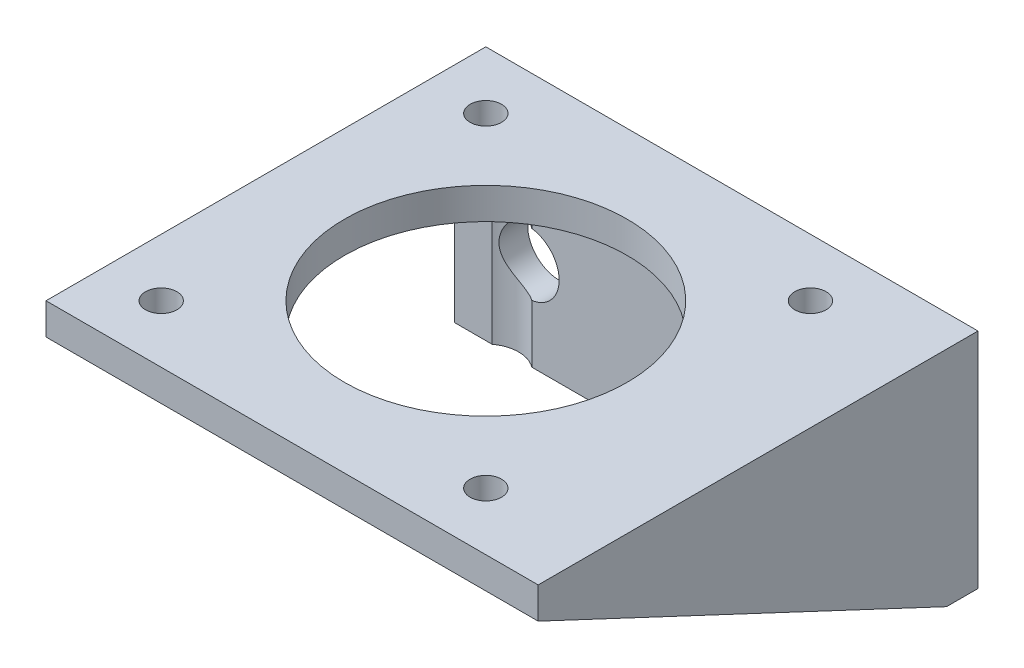
ISO-10303-21;
HEADER;
FILE_DESCRIPTION(('STEP AP214'),'2;1');
FILE_NAME('part.step','',(''),(''),'','','');
FILE_SCHEMA(('AUTOMOTIVE_DESIGN { 1 0 10303 214 1 1 1 1 }'));
ENDSEC;
DATA;
#1=APPLICATION_CONTEXT('core data for automotive mechanical design processes');
#2=APPLICATION_PROTOCOL_DEFINITION('international standard','automotive_design',2000,#1);
#3=PRODUCT_CONTEXT('',#1,'mechanical');
#4=PRODUCT('Part','Part','',(#3));
#5=PRODUCT_RELATED_PRODUCT_CATEGORY('part','',(#4));
#6=PRODUCT_DEFINITION_FORMATION('','',#4);
#7=PRODUCT_DEFINITION_CONTEXT('part definition',#1,'design');
#8=PRODUCT_DEFINITION('design','',#6,#7);
#9=PRODUCT_DEFINITION_SHAPE('','',#8);
#10=(LENGTH_UNIT() NAMED_UNIT(*) SI_UNIT(.MILLI.,.METRE.));
#11=(NAMED_UNIT(*) PLANE_ANGLE_UNIT() SI_UNIT($,.RADIAN.));
#12=(NAMED_UNIT(*) SI_UNIT($,.STERADIAN.) SOLID_ANGLE_UNIT());
#13=UNCERTAINTY_MEASURE_WITH_UNIT(LENGTH_MEASURE(1.E-05),#10,'distance_accuracy_value','');
#14=(GEOMETRIC_REPRESENTATION_CONTEXT(3) GLOBAL_UNCERTAINTY_ASSIGNED_CONTEXT((#13)) GLOBAL_UNIT_ASSIGNED_CONTEXT((#10,
#11,#12)) REPRESENTATION_CONTEXT('',''));
#15=CARTESIAN_POINT('',(0.,0.,0.));
#16=DIRECTION('',(0.,0.,1.));
#17=DIRECTION('',(1.,0.,0.));
#18=AXIS2_PLACEMENT_3D('',#15,#16,#17);
#19=CARTESIAN_POINT('',(77.1447839151503,157.565968794144,3.));
#20=DIRECTION('',(0.,1.,0.));
#21=DIRECTION('',(0.,0.,1.));
#22=AXIS2_PLACEMENT_3D('',#19,#20,#21);
#23=PLANE('',#22);
#24=CARTESIAN_POINT('',(113.64478391515,157.565968794144,5.50017920588967));
#25=DIRECTION('',(0.,1.,0.));
#26=DIRECTION('',(0.,0.,1.));
#27=AXIS2_PLACEMENT_3D('',#24,#25,#26);
#28=CIRCLE('',#27,3.13434940060138);
#29=CARTESIAN_POINT('',(111.754479679455,157.565968794144,3.));
#30=VERTEX_POINT('',#29);
#31=CARTESIAN_POINT('',(115.535088150845,157.565968794144,3.));
#32=VERTEX_POINT('',#31);
#33=EDGE_CURVE('E130',#30,#32,#28,.F.);
#34=ORIENTED_EDGE('',*,*,#33,.F.);
#35=DIRECTION('',(1.,0.,0.));
#36=VECTOR('',#35,1.);
#37=CARTESIAN_POINT('',(77.1447839151503,157.565968794144,3.));
#38=LINE('',#37,#36);
#39=CARTESIAN_POINT('',(84.5350881508455,157.565968794144,3.));
#40=VERTEX_POINT('',#39);
#41=EDGE_CURVE('E327',#40,#30,#38,.T.);
#42=ORIENTED_EDGE('',*,*,#41,.F.);
#43=CARTESIAN_POINT('',(82.6447839151503,157.565968794144,5.50017920588967));
#44=DIRECTION('',(0.,1.,0.));
#45=DIRECTION('',(0.,0.,1.));
#46=AXIS2_PLACEMENT_3D('',#43,#44,#45);
#47=CIRCLE('',#46,3.13434940060138);
#48=CARTESIAN_POINT('',(80.7544796794551,157.565968794144,3.));
#49=VERTEX_POINT('',#48);
#50=EDGE_CURVE('E232',#49,#40,#47,.F.);
#51=ORIENTED_EDGE('',*,*,#50,.F.);
#52=CARTESIAN_POINT('',(77.1447839151503,157.565968794144,3.));
#53=VERTEX_POINT('',#52);
#54=EDGE_CURVE('E330',#53,#49,#38,.T.);
#55=ORIENTED_EDGE('',*,*,#54,.F.);
#56=DIRECTION('',(0.,0.,-1.));
#57=VECTOR('',#56,1.);
#58=CARTESIAN_POINT('',(77.1447839151503,157.565968794144,3.));
#59=LINE('',#58,#57);
#60=CARTESIAN_POINT('',(77.1447839151503,157.565968794144,0.));
#61=VERTEX_POINT('',#60);
#62=EDGE_CURVE('E11',#53,#61,#59,.T.);
#63=ORIENTED_EDGE('',*,*,#62,.T.);
#64=DIRECTION('',(1.,0.,0.));
#65=VECTOR('',#64,1.);
#66=CARTESIAN_POINT('',(77.1447839151503,157.565968794144,0.));
#67=LINE('',#66,#65);
#68=CARTESIAN_POINT('',(124.14478391515,157.565968794144,0.));
#69=VERTEX_POINT('',#68);
#70=EDGE_CURVE('E340',#61,#69,#67,.T.);
#71=ORIENTED_EDGE('',*,*,#70,.T.);
#72=DIRECTION('',(0.,0.,-1.));
#73=VECTOR('',#72,1.);
#74=CARTESIAN_POINT('',(124.14478391515,157.565968794144,3.));
#75=LINE('',#74,#73);
#76=CARTESIAN_POINT('',(124.14478391515,157.565968794144,3.));
#77=VERTEX_POINT('',#76);
#78=EDGE_CURVE('E218',#77,#69,#75,.T.);
#79=ORIENTED_EDGE('',*,*,#78,.F.);
#80=DIRECTION('',(-1.,0.,0.));
#81=VECTOR('',#80,1.);
#82=CARTESIAN_POINT('',(124.14478391515,157.565968794144,3.));
#83=LINE('',#82,#81);
#84=CARTESIAN_POINT('',(119.14478391515,157.565968794144,3.));
#85=VERTEX_POINT('',#84);
#86=EDGE_CURVE('E211',#77,#85,#83,.T.);
#87=ORIENTED_EDGE('',*,*,#86,.T.);
#88=EDGE_CURVE('E328',#32,#85,#38,.T.);
#89=ORIENTED_EDGE('',*,*,#88,.F.);
#90=EDGE_LOOP('',(#34,#42,#51,#55,#63,#71,#79,#87,#89));
#91=FACE_BOUND('',#90,.T.);
#92=ADVANCED_FACE('F32',(#91),#23,.F.);
#93=CARTESIAN_POINT('',(77.1447839151503,178.865968794144,3.));
#94=DIRECTION('',(0.,0.,-1.));
#95=DIRECTION('',(-1.,0.,0.));
#96=AXIS2_PLACEMENT_3D('',#93,#94,#95);
#97=PLANE('',#96);
#98=DIRECTION('',(0.,1.,0.));
#99=VECTOR('',#98,1.);
#100=CARTESIAN_POINT('',(111.754479679455,155.865968794144,3.));
#101=LINE('',#100,#99);
#102=CARTESIAN_POINT('',(111.754479679455,175.865968794144,3.));
#103=VERTEX_POINT('',#102);
#104=CARTESIAN_POINT('',(111.754479679455,169.040470870727,3.));
#105=VERTEX_POINT('',#104);
#106=EDGE_CURVE('E47',#103,#105,#101,.F.);
#107=ORIENTED_EDGE('',*,*,#106,.F.);
#108=DIRECTION('',(-1.,0.,0.));
#109=VECTOR('',#108,1.);
#110=CARTESIAN_POINT('',(77.1447839151503,175.865968794144,3.));
#111=LINE('',#110,#109);
#112=CARTESIAN_POINT('',(84.5350881508455,175.865968794144,3.));
#113=VERTEX_POINT('',#112);
#114=EDGE_CURVE('E144',#103,#113,#111,.T.);
#115=ORIENTED_EDGE('',*,*,#114,.T.);
#116=DIRECTION('',(0.,1.,0.));
#117=VECTOR('',#116,1.);
#118=CARTESIAN_POINT('',(84.5350881508455,155.865968794144,3.));
#119=LINE('',#118,#117);
#120=CARTESIAN_POINT('',(84.5350881508455,169.040470870727,3.));
#121=VERTEX_POINT('',#120);
#122=EDGE_CURVE('E234',#121,#113,#119,.T.);
#123=ORIENTED_EDGE('',*,*,#122,.F.);
#124=CARTESIAN_POINT('',(84.1447839151503,166.065968794144,3.));
#125=DIRECTION('',(0.,0.,1.));
#126=DIRECTION('',(1.,0.,0.));
#127=AXIS2_PLACEMENT_3D('',#124,#125,#126);
#128=CIRCLE('',#127,3.00000000000001);
#129=CARTESIAN_POINT('',(84.5350881508455,163.09146671756,3.));
#130=VERTEX_POINT('',#129);
#131=EDGE_CURVE('E151',#130,#121,#128,.T.);
#132=ORIENTED_EDGE('',*,*,#131,.F.);
#133=EDGE_CURVE('E55',#40,#130,#119,.T.);
#134=ORIENTED_EDGE('',*,*,#133,.F.);
#135=ORIENTED_EDGE('',*,*,#41,.T.);
#136=CARTESIAN_POINT('',(111.754479679455,163.09146671756,3.));
#137=VERTEX_POINT('',#136);
#138=EDGE_CURVE('E319',#137,#30,#101,.F.);
#139=ORIENTED_EDGE('',*,*,#138,.F.);
#140=CARTESIAN_POINT('',(112.14478391515,166.065968794144,3.));
#141=DIRECTION('',(0.,0.,1.));
#142=DIRECTION('',(1.,0.,0.));
#143=AXIS2_PLACEMENT_3D('',#140,#141,#142);
#144=CIRCLE('',#143,3.00000000000001);
#145=EDGE_CURVE('E383',#105,#137,#144,.T.);
#146=ORIENTED_EDGE('',*,*,#145,.F.);
#147=EDGE_LOOP('',(#107,#115,#123,#132,#134,#135,#139,#146));
#148=FACE_BOUND('',#147,.T.);
#149=ADVANCED_FACE('F294',(#148),#97,.F.);
#150=DIRECTION('',(0.,1.,0.));
#151=VECTOR('',#150,1.);
#152=CARTESIAN_POINT('',(115.535088150845,155.865968794144,3.));
#153=LINE('',#152,#151);
#154=CARTESIAN_POINT('',(115.535088150845,175.865968794144,3.));
#155=VERTEX_POINT('',#154);
#156=EDGE_CURVE('E125',#32,#155,#153,.T.);
#157=ORIENTED_EDGE('',*,*,#156,.F.);
#158=ORIENTED_EDGE('',*,*,#88,.T.);
#159=DIRECTION('',(0.,1.,0.));
#160=VECTOR('',#159,1.);
#161=CARTESIAN_POINT('',(119.14478391515,157.565968794144,3.));
#162=LINE('',#161,#160);
#163=CARTESIAN_POINT('',(119.14478391515,175.865968794144,3.));
#164=VERTEX_POINT('',#163);
#165=EDGE_CURVE('E150',#85,#164,#162,.T.);
#166=ORIENTED_EDGE('',*,*,#165,.T.);
#167=EDGE_CURVE('E142',#164,#155,#111,.T.);
#168=ORIENTED_EDGE('',*,*,#167,.T.);
#169=EDGE_LOOP('',(#157,#158,#166,#168));
#170=FACE_BOUND('',#169,.T.);
#171=ADVANCED_FACE('F148',(#170),#97,.F.);
#172=CARTESIAN_POINT('',(112.14478391515,166.065968794144,0.));
#173=DIRECTION('',(0.,0.,1.));
#174=DIRECTION('',(1.,0.,0.));
#175=AXIS2_PLACEMENT_3D('',#172,#173,#174);
#176=CYLINDRICAL_SURFACE('',#175,3.00000000000001);
#177=CARTESIAN_POINT('',(112.14478391515,166.065968794144,0.));
#178=DIRECTION('',(0.,0.,1.));
#179=DIRECTION('',(1.,0.,0.));
#180=AXIS2_PLACEMENT_3D('',#177,#178,#179);
#181=CIRCLE('',#180,3.00000000000001);
#182=CARTESIAN_POINT('',(115.14478391515,166.065968794144,0.));
#183=VERTEX_POINT('',#182);
#184=EDGE_CURVE('E341',#183,#183,#181,.T.);
#185=ORIENTED_EDGE('',*,*,#184,.F.);
#186=EDGE_LOOP('',(#185));
#187=FACE_BOUND('',#186,.T.);
#188=CARTESIAN_POINT('',(111.754479679455,169.040470870727,3.));
#189=CARTESIAN_POINT('',(111.807241165498,169.047398750531,2.96009950952061));
#190=CARTESIAN_POINT('',(111.861392910043,169.053071317085,2.92179186020854));
#191=CARTESIAN_POINT('',(111.972209728457,169.061515830034,2.84856758024539));
#192=CARTESIAN_POINT('',(112.028876510419,169.064285772686,2.81365330718006));
#193=CARTESIAN_POINT('',(112.144491565869,169.06652651169,2.74741436383865));
#194=CARTESIAN_POINT('',(112.203443943069,169.065991072186,2.71609659203178));
#195=CARTESIAN_POINT('',(112.323077566866,169.061265769476,2.65734795097251));
#196=CARTESIAN_POINT('',(112.383758397043,169.057076779399,2.62991615486653));
#197=CARTESIAN_POINT('',(112.568293469794,169.038493022818,2.55348399757745));
#198=CARTESIAN_POINT('',(112.694211691861,169.018068332499,2.51059172224993));
#199=CARTESIAN_POINT('',(112.946338042062,168.959795009431,2.44184771531341));
#200=CARTESIAN_POINT('',(113.072545130703,168.921980327198,2.41596301784283));
#201=CARTESIAN_POINT('',(113.313752898231,168.83168087302,2.38111111928611));
#202=CARTESIAN_POINT('',(113.428984930558,168.780138908747,2.37127571495604));
#203=CARTESIAN_POINT('',(113.652380511964,168.662718198824,2.36384236019069));
#204=CARTESIAN_POINT('',(113.760536753154,168.596824925861,2.36625686551768));
#205=CARTESIAN_POINT('',(113.973417557881,168.447979464264,2.38117062313417));
#206=CARTESIAN_POINT('',(114.077545688311,168.364240304641,2.39426696601608));
#207=CARTESIAN_POINT('',(114.273119895231,168.184425150913,2.42785090056312));
#208=CARTESIAN_POINT('',(114.364561824964,168.088345142608,2.44834090115937));
#209=CARTESIAN_POINT('',(114.548132290552,167.868147199951,2.49707982313188));
#210=CARTESIAN_POINT('',(114.637688725855,167.742046745113,2.52605675051341));
#211=CARTESIAN_POINT('',(114.796518132387,167.477396188589,2.58387653723346));
#212=CARTESIAN_POINT('',(114.865770527551,167.338833642342,2.61271923161886));
#213=CARTESIAN_POINT('',(114.956412424969,167.115796584693,2.65324629721041));
#214=CARTESIAN_POINT('',(114.985388723487,167.034684129988,2.66685548386954));
#215=CARTESIAN_POINT('',(115.036337260104,166.869924582049,2.69152663529153));
#216=CARTESIAN_POINT('',(115.058312640323,166.786278644393,2.70258974215383));
#217=CARTESIAN_POINT('',(115.09498660488,166.617135998744,2.72142335739966));
#218=CARTESIAN_POINT('',(115.109693150865,166.531641423238,2.7291974669133));
#219=CARTESIAN_POINT('',(115.131655602582,166.359442951891,2.74091917376305));
#220=CARTESIAN_POINT('',(115.138912633582,166.272739240698,2.74486734901061));
#221=CARTESIAN_POINT('',(115.145534850417,166.1071602075,2.74846999118184));
#222=CARTESIAN_POINT('',(115.145580995801,166.028319371839,2.74849494842985));
#223=CARTESIAN_POINT('',(115.139472891832,165.870923272253,2.74517226569997));
#224=CARTESIAN_POINT('',(115.133316553268,165.792368113502,2.74182348933225));
#225=CARTESIAN_POINT('',(115.114879378002,165.636183979926,2.73195330083328));
#226=CARTESIAN_POINT('',(115.102598649711,165.558554988732,2.72543194486175));
#227=CARTESIAN_POINT('',(115.072062242318,165.404759622836,2.70960323413091));
#228=CARTESIAN_POINT('',(115.053804098635,165.328593865187,2.70029473032276));
#229=CARTESIAN_POINT('',(114.992014397557,165.109026939155,2.66977408813007));
#230=CARTESIAN_POINT('',(114.940677928397,164.968173938518,2.64548488747308));
#231=CARTESIAN_POINT('',(114.818028003355,164.696269268496,2.59293447094592));
#232=CARTESIAN_POINT('',(114.746698287858,164.565225687041,2.5646700315519));
#233=CARTESIAN_POINT('',(114.575145169646,164.299213063954,2.50554871520531));
#234=CARTESIAN_POINT('',(114.47241785415,164.165818554898,2.47481215810874));
#235=CARTESIAN_POINT('',(114.245091933422,163.917251269634,2.42164860289372));
#236=CARTESIAN_POINT('',(114.120516028573,163.802059814573,2.39921305465066));
#237=CARTESIAN_POINT('',(113.879697801667,163.614765311404,2.37279788837075));
#238=CARTESIAN_POINT('',(113.766882260508,163.538660935271,2.36599962165018));
#239=CARTESIAN_POINT('',(113.531951313608,163.402484827779,2.36566682956812));
#240=CARTESIAN_POINT('',(113.409845377408,163.342397045095,2.37211896817694));
#241=CARTESIAN_POINT('',(113.159607846537,163.239574517229,2.40103944937335));
#242=CARTESIAN_POINT('',(113.031451307497,163.196920174624,2.42358071244523));
#243=CARTESIAN_POINT('',(112.774585341323,163.129819542617,2.48615212522214));
#244=CARTESIAN_POINT('',(112.64587577091,163.105378298697,2.52618711625805));
#245=CARTESIAN_POINT('',(112.402489268516,163.074726743498,2.61979767973562));
#246=CARTESIAN_POINT('',(112.287482161332,163.067291381708,2.67213892861141));
#247=CARTESIAN_POINT('',(112.06469289274,163.064972850779,2.7903220127202));
#248=CARTESIAN_POINT('',(111.95690264721,163.070075386942,2.85614839484385));
#249=CARTESIAN_POINT('',(111.820209829674,163.083384617957,2.95130132977167));
#250=CARTESIAN_POINT('',(111.787071153835,163.087186012692,2.97535085666324));
#251=CARTESIAN_POINT('',(111.754479679455,163.09146671756,3.));
#252=B_SPLINE_CURVE_WITH_KNOTS('',3,(#188,#189,#190,#191,#192,#193,#194,#195,#196,#197,#198,
#199,#200,#201,#202,#203,#204,#205,#206,#207,#208,#209,#210,#211,#212,#213,#214,#215,#216,#217,
#218,#219,#220,#221,#222,#223,#224,#225,#226,#227,#228,#229,#230,#231,#232,#233,#234,#235,#236,
#237,#238,#239,#240,#241,#242,#243,#244,#245,#246,#247,#248,#249,#250,#251),.UNSPECIFIED.,.F.,
.F.,(4,2,2,2,2,2,2,2,2,2,2,2,2,2,2,2,2,2,2,2,2,2,2,2,2,2,2,2,2,2,2,4),(0.,0.199514071354091,
0.399165781034447,0.599194263914631,0.799174956892081,1.20059821554179,1.60124108024834,
1.97939083119544,2.35792516349336,2.75919853062522,3.16060275504447,3.63085226042168,
4.10157668123125,4.36288052878185,4.62406693335047,4.88496661960254,5.14582689053295,
5.38203637473139,5.61832544904167,5.85461034081138,6.0909927794645,6.54464602766998,
6.99866928763445,7.50972273437824,8.02024831566337,8.42732049032134,8.83398316309133,
9.24250074663651,9.65113145773541,10.0292491086296,10.4069358603642,10.530245763783),.UNSPECIFIED.);
#253=EDGE_CURVE('E145',#105,#137,#252,.T.);
#254=ORIENTED_EDGE('',*,*,#253,.F.);
#255=ORIENTED_EDGE('',*,*,#145,.T.);
#256=EDGE_LOOP('',(#254,#255));
#257=FACE_BOUND('',#256,.T.);
#258=ADVANCED_FACE('F310',(#187,#257),#176,.F.);
#259=DIRECTION('',(0.,1.,0.));
#260=VECTOR('',#259,1.);
#261=CARTESIAN_POINT('',(80.7544796794551,155.865968794144,3.));
#262=LINE('',#261,#260);
#263=CARTESIAN_POINT('',(80.7544796794551,175.865968794144,3.));
#264=VERTEX_POINT('',#263);
#265=EDGE_CURVE('E219',#264,#49,#262,.F.);
#266=ORIENTED_EDGE('',*,*,#265,.F.);
#267=CARTESIAN_POINT('',(77.1447839151503,175.865968794144,3.));
#268=VERTEX_POINT('',#267);
#269=EDGE_CURVE('E153',#264,#268,#111,.T.);
#270=ORIENTED_EDGE('',*,*,#269,.T.);
#271=DIRECTION('',(0.,-1.,0.));
#272=VECTOR('',#271,1.);
#273=CARTESIAN_POINT('',(77.1447839151503,157.565968794144,3.));
#274=LINE('',#273,#272);
#275=EDGE_CURVE('E333',#268,#53,#274,.T.);
#276=ORIENTED_EDGE('',*,*,#275,.T.);
#277=ORIENTED_EDGE('',*,*,#54,.T.);
#278=EDGE_LOOP('',(#266,#270,#276,#277));
#279=FACE_BOUND('',#278,.T.);
#280=ADVANCED_FACE('F301',(#279),#97,.F.);
#281=CARTESIAN_POINT('',(84.1447839151503,166.065968794144,0.));
#282=DIRECTION('',(0.,0.,1.));
#283=DIRECTION('',(1.,0.,0.));
#284=AXIS2_PLACEMENT_3D('',#281,#282,#283);
#285=CYLINDRICAL_SURFACE('',#284,3.00000000000001);
#286=CARTESIAN_POINT('',(84.1447839151503,166.065968794144,0.));
#287=DIRECTION('',(0.,0.,1.));
#288=DIRECTION('',(1.,0.,0.));
#289=AXIS2_PLACEMENT_3D('',#286,#287,#288);
#290=CIRCLE('',#289,3.00000000000001);
#291=CARTESIAN_POINT('',(87.1447839151503,166.065968794144,0.));
#292=VERTEX_POINT('',#291);
#293=EDGE_CURVE('E155',#292,#292,#290,.T.);
#294=ORIENTED_EDGE('',*,*,#293,.F.);
#295=EDGE_LOOP('',(#294));
#296=FACE_BOUND('',#295,.T.);
#297=CARTESIAN_POINT('',(84.5350881508455,163.09146671756,3.));
#298=CARTESIAN_POINT('',(84.4823266648026,163.084538837757,2.96009950952061));
#299=CARTESIAN_POINT('',(84.4281749202579,163.078866271203,2.92179186020854));
#300=CARTESIAN_POINT('',(84.317358101844,163.070421758253,2.84856758024539));
#301=CARTESIAN_POINT('',(84.2606913198816,163.067651815602,2.81365330718006));
#302=CARTESIAN_POINT('',(84.1450762644313,163.065411076597,2.74741436383865));
#303=CARTESIAN_POINT('',(84.0861238872312,163.065946516101,2.71609659203178));
#304=CARTESIAN_POINT('',(83.966490263435,163.070671818811,2.65734795097251));
#305=CARTESIAN_POINT('',(83.9058094332577,163.074860808889,2.62991615486653));
#306=CARTESIAN_POINT('',(83.721274360507,163.093444565469,2.55348399757745));
#307=CARTESIAN_POINT('',(83.5953561384393,163.113869255788,2.51059172224993));
#308=CARTESIAN_POINT('',(83.3432297882384,163.172142578856,2.44184771531341));
#309=CARTESIAN_POINT('',(83.2170226995973,163.209957261089,2.41596301784283));
#310=CARTESIAN_POINT('',(82.9758149320699,163.300256715267,2.38111111928611));
#311=CARTESIAN_POINT('',(82.8605828997426,163.351798679541,2.37127571495603));
#312=CARTESIAN_POINT('',(82.6371873183362,163.469219389464,2.36384236019069));
#313=CARTESIAN_POINT('',(82.5290310771467,163.535112662426,2.36625686551768));
#314=CARTESIAN_POINT('',(82.3161502724197,163.683958124023,2.38117062313417));
#315=CARTESIAN_POINT('',(82.2120221419892,163.767697283646,2.39426696601608));
#316=CARTESIAN_POINT('',(82.0164479350698,163.947512437374,2.42785090056312));
#317=CARTESIAN_POINT('',(81.9250060053365,164.043592445679,2.44834090115937));
#318=CARTESIAN_POINT('',(81.7414355397483,164.263790388336,2.49707982313189));
#319=CARTESIAN_POINT('',(81.6518791044454,164.389890843174,2.52605675051342));
#320=CARTESIAN_POINT('',(81.4930496979141,164.654541399698,2.58387653723346));
#321=CARTESIAN_POINT('',(81.4237973027495,164.793103945945,2.61271923161886));
#322=CARTESIAN_POINT('',(81.3331554053317,165.016141003594,2.65324629721042));
#323=CARTESIAN_POINT('',(81.3041791068138,165.097253458299,2.66685548386956));
#324=CARTESIAN_POINT('',(81.253230570197,165.262013006238,2.69152663529155));
#325=CARTESIAN_POINT('',(81.2312551899774,165.345658943894,2.70258974215384));
#326=CARTESIAN_POINT('',(81.1945812254203,165.514801589544,2.72142335739968));
#327=CARTESIAN_POINT('',(81.1798746794356,165.600296165049,2.72919746691332));
#328=CARTESIAN_POINT('',(81.1579122277184,165.772494636396,2.74091917376307));
#329=CARTESIAN_POINT('',(81.150655196719,165.859198347589,2.74486734901062));
#330=CARTESIAN_POINT('',(81.1440329798832,166.024777380787,2.74846999118186));
#331=CARTESIAN_POINT('',(81.1439868344994,166.103618216448,2.74849494842986));
#332=CARTESIAN_POINT('',(81.1500949384687,166.261014316034,2.74517226569999));
#333=CARTESIAN_POINT('',(81.1562512770324,166.339569474785,2.74182348933226));
#334=CARTESIAN_POINT('',(81.1746884522985,166.495753608361,2.73195330083329));
#335=CARTESIAN_POINT('',(81.1869691805895,166.573382599555,2.72543194486176));
#336=CARTESIAN_POINT('',(81.2175055879827,166.727177965451,2.70960323413092));
#337=CARTESIAN_POINT('',(81.2357637316659,166.803343723101,2.70029473032278));
#338=CARTESIAN_POINT('',(81.2975534327439,167.022910649132,2.66977408813009));
#339=CARTESIAN_POINT('',(81.3488899019039,167.163763649769,2.64548488747311));
#340=CARTESIAN_POINT('',(81.4715398269459,167.435668319791,2.59293447094594));
#341=CARTESIAN_POINT('',(81.5428695424428,167.566711901246,2.56467003155192));
#342=CARTESIAN_POINT('',(81.7144226606545,167.832724524333,2.50554871520532));
#343=CARTESIAN_POINT('',(81.8171499761507,167.966119033389,2.47481215810875));
#344=CARTESIAN_POINT('',(82.0444758968785,168.214686318653,2.42164860289373));
#345=CARTESIAN_POINT('',(82.169051801728,168.329877773714,2.39921305465067));
#346=CARTESIAN_POINT('',(82.4098700286332,168.517172276883,2.37279788837075));
#347=CARTESIAN_POINT('',(82.5226855697928,168.593276653016,2.36599962165018));
#348=CARTESIAN_POINT('',(82.7576165166923,168.729452760508,2.36566682956812));
#349=CARTESIAN_POINT('',(82.8797224528926,168.789540543192,2.37211896817694));
#350=CARTESIAN_POINT('',(83.1299599837631,168.892363071059,2.40103944937334));
#351=CARTESIAN_POINT('',(83.2581165228033,168.935017413663,2.42358071244523));
#352=CARTESIAN_POINT('',(83.5149824889773,169.00211804567,2.48615212522213));
#353=CARTESIAN_POINT('',(83.6436920593903,169.02655928959,2.52618711625804));
#354=CARTESIAN_POINT('',(83.8870785617844,169.057210844789,2.61979767973561));
#355=CARTESIAN_POINT('',(84.0020856689681,169.064646206579,2.6721389286114));
#356=CARTESIAN_POINT('',(84.2248749375606,169.066964737508,2.79032201272019));
#357=CARTESIAN_POINT('',(84.3326651830907,169.061862201345,2.85614839484384));
#358=CARTESIAN_POINT('',(84.4693580006267,169.04855297033,2.95130132977166));
#359=CARTESIAN_POINT('',(84.5024966764658,169.044751575596,2.97535085666324));
#360=CARTESIAN_POINT('',(84.5350881508455,169.040470870727,3.));
#361=B_SPLINE_CURVE_WITH_KNOTS('',3,(#297,#298,#299,#300,#301,#302,#303,#304,#305,#306,#307,
#308,#309,#310,#311,#312,#313,#314,#315,#316,#317,#318,#319,#320,#321,#322,#323,#324,#325,#326,
#327,#328,#329,#330,#331,#332,#333,#334,#335,#336,#337,#338,#339,#340,#341,#342,#343,#344,#345,
#346,#347,#348,#349,#350,#351,#352,#353,#354,#355,#356,#357,#358,#359,#360),.UNSPECIFIED.,.F.,
.F.,(4,2,2,2,2,2,2,2,2,2,2,2,2,2,2,2,2,2,2,2,2,2,2,2,2,2,2,2,2,2,2,4),(0.,0.199514071354091,
0.399165781034447,0.599194263914631,0.799174956892081,1.2005982155418,1.60124108024834,
1.97939083119547,2.35792516349335,2.75919853062522,3.16060275504446,3.63085226042168,
4.10157668123124,4.36288052878191,4.6240669333505,4.88496661960259,5.14582689053292,
5.38203637473136,5.6183254490417,5.8546103408114,6.09099277946449,6.54464602766994,
6.99866928763444,7.50972273437824,8.02024831566336,8.42732049032136,8.83398316309135,
9.24250074663654,9.65113145773543,10.0292491086297,10.4069358603643,10.530245763783),.UNSPECIFIED.);
#362=EDGE_CURVE('E237',#130,#121,#361,.T.);
#363=ORIENTED_EDGE('',*,*,#362,.F.);
#364=ORIENTED_EDGE('',*,*,#131,.T.);
#365=EDGE_LOOP('',(#363,#364));
#366=FACE_BOUND('',#365,.T.);
#367=ADVANCED_FACE('F244',(#296,#366),#285,.F.);
#368=CARTESIAN_POINT('',(77.1447839151503,157.565968794144,3.));
#369=DIRECTION('',(1.,0.,0.));
#370=DIRECTION('',(0.,0.,-1.));
#371=AXIS2_PLACEMENT_3D('',#368,#369,#370);
#372=PLANE('',#371);
#373=ORIENTED_EDGE('',*,*,#275,.F.);
#374=DIRECTION('',(0.,0.,1.));
#375=VECTOR('',#374,1.);
#376=CARTESIAN_POINT('',(77.1447839151503,175.865968794144,0.));
#377=LINE('',#376,#375);
#378=CARTESIAN_POINT('',(77.1447839151503,175.865968794144,42.));
#379=VERTEX_POINT('',#378);
#380=EDGE_CURVE('E171',#268,#379,#377,.T.);
#381=ORIENTED_EDGE('',*,*,#380,.T.);
#382=DIRECTION('',(0.,1.,0.));
#383=VECTOR('',#382,1.);
#384=CARTESIAN_POINT('',(77.1447839151503,175.865968794144,42.));
#385=LINE('',#384,#383);
#386=CARTESIAN_POINT('',(77.1447839151503,178.865968794144,42.));
#387=VERTEX_POINT('',#386);
#388=EDGE_CURVE('E159',#379,#387,#385,.T.);
#389=ORIENTED_EDGE('',*,*,#388,.T.);
#390=DIRECTION('',(0.,0.,-1.));
#391=VECTOR('',#390,1.);
#392=CARTESIAN_POINT('',(77.1447839151503,178.865968794144,3.));
#393=LINE('',#392,#391);
#394=CARTESIAN_POINT('',(77.1447839151503,178.865968794144,0.));
#395=VERTEX_POINT('',#394);
#396=EDGE_CURVE('E40',#387,#395,#393,.T.);
#397=ORIENTED_EDGE('',*,*,#396,.T.);
#398=DIRECTION('',(0.,-1.,0.));
#399=VECTOR('',#398,1.);
#400=CARTESIAN_POINT('',(77.1447839151503,157.565968794144,0.));
#401=LINE('',#400,#399);
#402=EDGE_CURVE('E338',#395,#61,#401,.T.);
#403=ORIENTED_EDGE('',*,*,#402,.T.);
#404=ORIENTED_EDGE('',*,*,#62,.F.);
#405=EDGE_LOOP('',(#373,#381,#389,#397,#403,#404));
#406=FACE_BOUND('',#405,.T.);
#407=ADVANCED_FACE('F34',(#406),#372,.F.);
#408=CARTESIAN_POINT('',(77.1447839151503,178.865968794144,3.));
#409=DIRECTION('',(0.,-1.,0.));
#410=DIRECTION('',(0.,0.,-1.));
#411=AXIS2_PLACEMENT_3D('',#408,#409,#410);
#412=PLANE('',#411);
#413=DIRECTION('',(-1.,0.,0.));
#414=VECTOR('',#413,1.);
#415=CARTESIAN_POINT('',(77.1447839151503,178.865968794144,0.));
#416=LINE('',#415,#414);
#417=CARTESIAN_POINT('',(124.14478391515,178.865968794144,0.));
#418=VERTEX_POINT('',#417);
#419=EDGE_CURVE('E343',#418,#395,#416,.T.);
#420=ORIENTED_EDGE('',*,*,#419,.T.);
#421=ORIENTED_EDGE('',*,*,#396,.F.);
#422=DIRECTION('',(1.,0.,0.));
#423=VECTOR('',#422,1.);
#424=CARTESIAN_POINT('',(119.14478391515,178.865968794144,42.));
#425=LINE('',#424,#423);
#426=CARTESIAN_POINT('',(124.14478391515,178.865968794144,42.));
#427=VERTEX_POINT('',#426);
#428=EDGE_CURVE('E174',#387,#427,#425,.T.);
#429=ORIENTED_EDGE('',*,*,#428,.T.);
#430=DIRECTION('',(0.,0.,1.));
#431=VECTOR('',#430,1.);
#432=CARTESIAN_POINT('',(124.14478391515,178.865968794144,0.));
#433=LINE('',#432,#431);
#434=EDGE_CURVE('E223',#418,#427,#433,.T.);
#435=ORIENTED_EDGE('',*,*,#434,.F.);
#436=EDGE_LOOP('',(#420,#421,#429,#435));
#437=FACE_BOUND('',#436,.T.);
#438=CARTESIAN_POINT('',(113.64478391515,178.865968794144,36.5001792058897));
#439=DIRECTION('',(0.,1.,0.));
#440=DIRECTION('',(0.,0.,1.));
#441=AXIS2_PLACEMENT_3D('',#438,#439,#440);
#442=CIRCLE('',#441,1.5);
#443=CARTESIAN_POINT('',(113.64478391515,178.865968794144,38.0001792058897));
#444=VERTEX_POINT('',#443);
#445=EDGE_CURVE('E180',#444,#444,#442,.T.);
#446=ORIENTED_EDGE('',*,*,#445,.F.);
#447=EDGE_LOOP('',(#446));
#448=FACE_BOUND('',#447,.T.);
#449=CARTESIAN_POINT('',(82.6447839151503,178.865968794144,36.5001792058897));
#450=DIRECTION('',(0.,1.,0.));
#451=DIRECTION('',(0.,0.,1.));
#452=AXIS2_PLACEMENT_3D('',#449,#450,#451);
#453=CIRCLE('',#452,1.5);
#454=CARTESIAN_POINT('',(82.6447839151503,178.865968794144,38.0001792058897));
#455=VERTEX_POINT('',#454);
#456=EDGE_CURVE('E186',#455,#455,#453,.T.);
#457=ORIENTED_EDGE('',*,*,#456,.F.);
#458=EDGE_LOOP('',(#457));
#459=FACE_BOUND('',#458,.T.);
#460=CARTESIAN_POINT('',(82.6447839151503,178.865968794144,5.50017920588968));
#461=DIRECTION('',(0.,1.,0.));
#462=DIRECTION('',(0.,0.,1.));
#463=AXIS2_PLACEMENT_3D('',#460,#461,#462);
#464=CIRCLE('',#463,1.5);
#465=CARTESIAN_POINT('',(82.6447839151503,178.865968794144,7.00017920588967));
#466=VERTEX_POINT('',#465);
#467=EDGE_CURVE('E192',#466,#466,#464,.T.);
#468=ORIENTED_EDGE('',*,*,#467,.F.);
#469=EDGE_LOOP('',(#468));
#470=FACE_BOUND('',#469,.T.);
#471=CARTESIAN_POINT('',(113.64478391515,178.865968794144,5.50017920588967));
#472=DIRECTION('',(0.,1.,0.));
#473=DIRECTION('',(0.,0.,1.));
#474=AXIS2_PLACEMENT_3D('',#471,#472,#473);
#475=CIRCLE('',#474,1.5);
#476=CARTESIAN_POINT('',(113.64478391515,178.865968794144,7.00017920588967));
#477=VERTEX_POINT('',#476);
#478=EDGE_CURVE('E198',#477,#477,#475,.T.);
#479=ORIENTED_EDGE('',*,*,#478,.F.);
#480=EDGE_LOOP('',(#479));
#481=FACE_BOUND('',#480,.T.);
#482=CARTESIAN_POINT('',(98.1447839151503,178.865968794144,21.0001792058896));
#483=DIRECTION('',(0.,1.,0.));
#484=DIRECTION('',(0.,0.,1.));
#485=AXIS2_PLACEMENT_3D('',#482,#483,#484);
#486=CIRCLE('',#485,13.5);
#487=CARTESIAN_POINT('',(98.1447839151503,178.865968794144,34.5001792058896));
#488=VERTEX_POINT('',#487);
#489=EDGE_CURVE('E204',#488,#488,#486,.T.);
#490=ORIENTED_EDGE('',*,*,#489,.F.);
#491=EDGE_LOOP('',(#490));
#492=FACE_BOUND('',#491,.T.);
#493=ADVANCED_FACE('F303',(#437,#448,#459,#470,#481,#492),#412,.F.);
#494=CARTESIAN_POINT('',(77.1447839151503,178.865968794144,0.));
#495=DIRECTION('',(0.,0.,-1.));
#496=DIRECTION('',(-1.,0.,0.));
#497=AXIS2_PLACEMENT_3D('',#494,#495,#496);
#498=PLANE('',#497);
#499=ORIENTED_EDGE('',*,*,#70,.F.);
#500=ORIENTED_EDGE('',*,*,#402,.F.);
#501=ORIENTED_EDGE('',*,*,#419,.F.);
#502=DIRECTION('',(0.,1.,0.));
#503=VECTOR('',#502,1.);
#504=CARTESIAN_POINT('',(124.14478391515,157.565968794144,0.));
#505=LINE('',#504,#503);
#506=EDGE_CURVE('E226',#69,#418,#505,.T.);
#507=ORIENTED_EDGE('',*,*,#506,.F.);
#508=EDGE_LOOP('',(#499,#500,#501,#507));
#509=FACE_BOUND('',#508,.T.);
#510=ORIENTED_EDGE('',*,*,#293,.T.);
#511=EDGE_LOOP('',(#510));
#512=FACE_BOUND('',#511,.T.);
#513=ORIENTED_EDGE('',*,*,#184,.T.);
#514=EDGE_LOOP('',(#513));
#515=FACE_BOUND('',#514,.T.);
#516=ADVANCED_FACE('F288',(#509,#512,#515),#498,.T.);
#517=CARTESIAN_POINT('',(119.14478391515,175.865968794144,42.));
#518=DIRECTION('',(0.,-1.,0.));
#519=DIRECTION('',(0.,0.,-1.));
#520=AXIS2_PLACEMENT_3D('',#517,#518,#519);
#521=PLANE('',#520);
#522=ORIENTED_EDGE('',*,*,#114,.F.);
#523=CARTESIAN_POINT('',(113.64478391515,175.865968794144,5.50017920588967));
#524=DIRECTION('',(0.,-1.,0.));
#525=DIRECTION('',(0.,0.,-1.));
#526=AXIS2_PLACEMENT_3D('',#523,#524,#525);
#527=CIRCLE('',#526,3.13434940060138);
#528=EDGE_CURVE('E128',#103,#155,#527,.T.);
#529=ORIENTED_EDGE('',*,*,#528,.T.);
#530=ORIENTED_EDGE('',*,*,#167,.F.);
#531=DIRECTION('',(0.,0.,-1.));
#532=VECTOR('',#531,1.);
#533=CARTESIAN_POINT('',(119.14478391515,175.865968794144,0.));
#534=LINE('',#533,#532);
#535=CARTESIAN_POINT('',(119.14478391515,175.865968794144,42.));
#536=VERTEX_POINT('',#535);
#537=EDGE_CURVE('E175',#536,#164,#534,.T.);
#538=ORIENTED_EDGE('',*,*,#537,.F.);
#539=DIRECTION('',(1.,0.,0.));
#540=VECTOR('',#539,1.);
#541=CARTESIAN_POINT('',(119.14478391515,175.865968794144,42.));
#542=LINE('',#541,#540);
#543=EDGE_CURVE('E165',#379,#536,#542,.T.);
#544=ORIENTED_EDGE('',*,*,#543,.F.);
#545=ORIENTED_EDGE('',*,*,#380,.F.);
#546=ORIENTED_EDGE('',*,*,#269,.F.);
#547=CARTESIAN_POINT('',(82.6447839151503,175.865968794144,5.50017920588967));
#548=DIRECTION('',(0.,-1.,0.));
#549=DIRECTION('',(0.,0.,-1.));
#550=AXIS2_PLACEMENT_3D('',#547,#548,#549);
#551=CIRCLE('',#550,3.13434940060138);
#552=EDGE_CURVE('E134',#264,#113,#551,.T.);
#553=ORIENTED_EDGE('',*,*,#552,.T.);
#554=EDGE_LOOP('',(#522,#529,#530,#538,#544,#545,#546,#553));
#555=FACE_BOUND('',#554,.T.);
#556=CARTESIAN_POINT('',(113.64478391515,175.865968794144,5.50017920588967));
#557=DIRECTION('',(0.,1.,0.));
#558=DIRECTION('',(0.,0.,1.));
#559=AXIS2_PLACEMENT_3D('',#556,#557,#558);
#560=CIRCLE('',#559,1.5);
#561=CARTESIAN_POINT('',(113.64478391515,175.865968794144,7.00017920588967));
#562=VERTEX_POINT('',#561);
#563=EDGE_CURVE('E195',#562,#562,#560,.T.);
#564=ORIENTED_EDGE('',*,*,#563,.T.);
#565=EDGE_LOOP('',(#564));
#566=FACE_BOUND('',#565,.T.);
#567=CARTESIAN_POINT('',(113.64478391515,175.865968794144,36.5001792058897));
#568=DIRECTION('',(0.,1.,0.));
#569=DIRECTION('',(0.,0.,1.));
#570=AXIS2_PLACEMENT_3D('',#567,#568,#569);
#571=CIRCLE('',#570,1.5);
#572=CARTESIAN_POINT('',(113.64478391515,175.865968794144,38.0001792058897));
#573=VERTEX_POINT('',#572);
#574=EDGE_CURVE('E176',#573,#573,#571,.T.);
#575=ORIENTED_EDGE('',*,*,#574,.T.);
#576=EDGE_LOOP('',(#575));
#577=FACE_BOUND('',#576,.T.);
#578=CARTESIAN_POINT('',(82.6447839151503,175.865968794144,36.5001792058897));
#579=DIRECTION('',(0.,1.,0.));
#580=DIRECTION('',(0.,0.,1.));
#581=AXIS2_PLACEMENT_3D('',#578,#579,#580);
#582=CIRCLE('',#581,1.5);
#583=CARTESIAN_POINT('',(82.6447839151503,175.865968794144,38.0001792058897));
#584=VERTEX_POINT('',#583);
#585=EDGE_CURVE('E183',#584,#584,#582,.T.);
#586=ORIENTED_EDGE('',*,*,#585,.T.);
#587=EDGE_LOOP('',(#586));
#588=FACE_BOUND('',#587,.T.);
#589=CARTESIAN_POINT('',(98.1447839151503,175.865968794144,21.0001792058896));
#590=DIRECTION('',(0.,1.,0.));
#591=DIRECTION('',(0.,0.,1.));
#592=AXIS2_PLACEMENT_3D('',#589,#590,#591);
#593=CIRCLE('',#592,13.5);
#594=CARTESIAN_POINT('',(98.1447839151503,175.865968794144,34.5001792058896));
#595=VERTEX_POINT('',#594);
#596=EDGE_CURVE('E201',#595,#595,#593,.T.);
#597=ORIENTED_EDGE('',*,*,#596,.T.);
#598=EDGE_LOOP('',(#597));
#599=FACE_BOUND('',#598,.T.);
#600=CARTESIAN_POINT('',(82.6447839151503,175.865968794144,5.50017920588968));
#601=DIRECTION('',(0.,1.,0.));
#602=DIRECTION('',(0.,0.,1.));
#603=AXIS2_PLACEMENT_3D('',#600,#601,#602);
#604=CIRCLE('',#603,1.5);
#605=CARTESIAN_POINT('',(82.6447839151503,175.865968794144,7.00017920588967));
#606=VERTEX_POINT('',#605);
#607=EDGE_CURVE('E189',#606,#606,#604,.T.);
#608=ORIENTED_EDGE('',*,*,#607,.T.);
#609=EDGE_LOOP('',(#608));
#610=FACE_BOUND('',#609,.T.);
#611=ADVANCED_FACE('F139',(#555,#566,#577,#588,#599,#610),#521,.T.);
#612=CARTESIAN_POINT('',(119.14478391515,175.865968794144,42.));
#613=DIRECTION('',(0.,0.,1.));
#614=DIRECTION('',(1.,0.,0.));
#615=AXIS2_PLACEMENT_3D('',#612,#613,#614);
#616=PLANE('',#615);
#617=ORIENTED_EDGE('',*,*,#428,.F.);
#618=ORIENTED_EDGE('',*,*,#388,.F.);
#619=ORIENTED_EDGE('',*,*,#543,.T.);
#620=DIRECTION('',(-1.,0.,0.));
#621=VECTOR('',#620,1.);
#622=CARTESIAN_POINT('',(124.14478391515,175.865968794144,42.));
#623=LINE('',#622,#621);
#624=CARTESIAN_POINT('',(124.14478391515,175.865968794144,42.));
#625=VERTEX_POINT('',#624);
#626=EDGE_CURVE('E207',#625,#536,#623,.T.);
#627=ORIENTED_EDGE('',*,*,#626,.F.);
#628=DIRECTION('',(0.,-1.,0.));
#629=VECTOR('',#628,1.);
#630=CARTESIAN_POINT('',(124.14478391515,178.865968794144,42.));
#631=LINE('',#630,#629);
#632=EDGE_CURVE('E221',#427,#625,#631,.T.);
#633=ORIENTED_EDGE('',*,*,#632,.F.);
#634=EDGE_LOOP('',(#617,#618,#619,#627,#633));
#635=FACE_BOUND('',#634,.T.);
#636=ADVANCED_FACE('F285',(#635),#616,.T.);
#637=CARTESIAN_POINT('',(113.64478391515,175.865968794144,36.5001792058897));
#638=DIRECTION('',(0.,1.,0.));
#639=DIRECTION('',(0.,0.,1.));
#640=AXIS2_PLACEMENT_3D('',#637,#638,#639);
#641=CYLINDRICAL_SURFACE('',#640,1.5);
#642=ORIENTED_EDGE('',*,*,#574,.F.);
#643=EDGE_LOOP('',(#642));
#644=FACE_BOUND('',#643,.T.);
#645=ORIENTED_EDGE('',*,*,#445,.T.);
#646=EDGE_LOOP('',(#645));
#647=FACE_BOUND('',#646,.T.);
#648=ADVANCED_FACE('F281',(#644,#647),#641,.F.);
#649=CARTESIAN_POINT('',(82.6447839151503,175.865968794144,36.5001792058897));
#650=DIRECTION('',(0.,1.,0.));
#651=DIRECTION('',(0.,0.,1.));
#652=AXIS2_PLACEMENT_3D('',#649,#650,#651);
#653=CYLINDRICAL_SURFACE('',#652,1.5);
#654=ORIENTED_EDGE('',*,*,#585,.F.);
#655=EDGE_LOOP('',(#654));
#656=FACE_BOUND('',#655,.T.);
#657=ORIENTED_EDGE('',*,*,#456,.T.);
#658=EDGE_LOOP('',(#657));
#659=FACE_BOUND('',#658,.T.);
#660=ADVANCED_FACE('F277',(#656,#659),#653,.F.);
#661=CARTESIAN_POINT('',(82.6447839151503,175.865968794144,5.50017920588968));
#662=DIRECTION('',(0.,1.,0.));
#663=DIRECTION('',(0.,0.,1.));
#664=AXIS2_PLACEMENT_3D('',#661,#662,#663);
#665=CYLINDRICAL_SURFACE('',#664,1.5);
#666=ORIENTED_EDGE('',*,*,#607,.F.);
#667=EDGE_LOOP('',(#666));
#668=FACE_BOUND('',#667,.T.);
#669=ORIENTED_EDGE('',*,*,#467,.T.);
#670=EDGE_LOOP('',(#669));
#671=FACE_BOUND('',#670,.T.);
#672=ADVANCED_FACE('F273',(#668,#671),#665,.F.);
#673=CARTESIAN_POINT('',(113.64478391515,175.865968794144,5.50017920588967));
#674=DIRECTION('',(0.,1.,0.));
#675=DIRECTION('',(0.,0.,1.));
#676=AXIS2_PLACEMENT_3D('',#673,#674,#675);
#677=CYLINDRICAL_SURFACE('',#676,1.5);
#678=ORIENTED_EDGE('',*,*,#563,.F.);
#679=EDGE_LOOP('',(#678));
#680=FACE_BOUND('',#679,.T.);
#681=ORIENTED_EDGE('',*,*,#478,.T.);
#682=EDGE_LOOP('',(#681));
#683=FACE_BOUND('',#682,.T.);
#684=ADVANCED_FACE('F269',(#680,#683),#677,.F.);
#685=CARTESIAN_POINT('',(98.1447839151503,175.865968794144,21.0001792058896));
#686=DIRECTION('',(0.,1.,0.));
#687=DIRECTION('',(0.,0.,1.));
#688=AXIS2_PLACEMENT_3D('',#685,#686,#687);
#689=CYLINDRICAL_SURFACE('',#688,13.5);
#690=ORIENTED_EDGE('',*,*,#596,.F.);
#691=EDGE_LOOP('',(#690));
#692=FACE_BOUND('',#691,.T.);
#693=ORIENTED_EDGE('',*,*,#489,.T.);
#694=EDGE_LOOP('',(#693));
#695=FACE_BOUND('',#694,.T.);
#696=ADVANCED_FACE('F262',(#692,#695),#689,.F.);
#697=CARTESIAN_POINT('',(119.14478391515,157.565968794144,0.));
#698=DIRECTION('',(1.,0.,0.));
#699=DIRECTION('',(0.,0.,-1.));
#700=AXIS2_PLACEMENT_3D('',#697,#698,#699);
#701=PLANE('',#700);
#702=DIRECTION('',(0.,-0.424790674352243,-0.905291601078551));
#703=VECTOR('',#702,1.);
#704=CARTESIAN_POINT('',(119.14478391515,175.865968794144,42.));
#705=LINE('',#704,#703);
#706=EDGE_CURVE('E215',#536,#85,#705,.T.);
#707=ORIENTED_EDGE('',*,*,#706,.F.);
#708=ORIENTED_EDGE('',*,*,#537,.T.);
#709=ORIENTED_EDGE('',*,*,#165,.F.);
#710=EDGE_LOOP('',(#707,#708,#709));
#711=FACE_BOUND('',#710,.T.);
#712=ADVANCED_FACE('F259',(#711),#701,.F.);
#713=CARTESIAN_POINT('',(124.14478391515,175.865968794144,42.));
#714=DIRECTION('',(0.,0.905291601078551,-0.424790674352243));
#715=DIRECTION('',(0.,0.424790674352243,0.905291601078551));
#716=AXIS2_PLACEMENT_3D('',#713,#714,#715);
#717=PLANE('',#716);
#718=ORIENTED_EDGE('',*,*,#706,.T.);
#719=ORIENTED_EDGE('',*,*,#86,.F.);
#720=DIRECTION('',(0.,-0.424790674352243,-0.905291601078551));
#721=VECTOR('',#720,1.);
#722=CARTESIAN_POINT('',(124.14478391515,175.865968794144,42.));
#723=LINE('',#722,#721);
#724=EDGE_CURVE('E214',#625,#77,#723,.T.);
#725=ORIENTED_EDGE('',*,*,#724,.F.);
#726=ORIENTED_EDGE('',*,*,#626,.T.);
#727=EDGE_LOOP('',(#718,#719,#725,#726));
#728=FACE_BOUND('',#727,.T.);
#729=ADVANCED_FACE('F257',(#728),#717,.F.);
#730=CARTESIAN_POINT('',(124.14478391515,157.565968794144,0.));
#731=DIRECTION('',(1.,0.,0.));
#732=DIRECTION('',(0.,0.,-1.));
#733=AXIS2_PLACEMENT_3D('',#730,#731,#732);
#734=PLANE('',#733);
#735=ORIENTED_EDGE('',*,*,#78,.T.);
#736=ORIENTED_EDGE('',*,*,#506,.T.);
#737=ORIENTED_EDGE('',*,*,#434,.T.);
#738=ORIENTED_EDGE('',*,*,#632,.T.);
#739=ORIENTED_EDGE('',*,*,#724,.T.);
#740=EDGE_LOOP('',(#735,#736,#737,#738,#739));
#741=FACE_BOUND('',#740,.T.);
#742=ADVANCED_FACE('F253',(#741),#734,.T.);
#743=CARTESIAN_POINT('',(82.6447839151503,155.865968794144,5.50017920588967));
#744=DIRECTION('',(0.,1.,0.));
#745=DIRECTION('',(0.,0.,1.));
#746=AXIS2_PLACEMENT_3D('',#743,#744,#745);
#747=CYLINDRICAL_SURFACE('',#746,3.13434940060138);
#748=ORIENTED_EDGE('',*,*,#265,.T.);
#749=ORIENTED_EDGE('',*,*,#50,.T.);
#750=ORIENTED_EDGE('',*,*,#133,.T.);
#751=ORIENTED_EDGE('',*,*,#362,.T.);
#752=ORIENTED_EDGE('',*,*,#122,.T.);
#753=ORIENTED_EDGE('',*,*,#552,.F.);
#754=EDGE_LOOP('',(#748,#749,#750,#751,#752,#753));
#755=FACE_BOUND('',#754,.T.);
#756=ADVANCED_FACE('F248',(#755),#747,.F.);
#757=CARTESIAN_POINT('',(113.64478391515,155.865968794144,5.50017920588967));
#758=DIRECTION('',(0.,1.,0.));
#759=DIRECTION('',(0.,0.,1.));
#760=AXIS2_PLACEMENT_3D('',#757,#758,#759);
#761=CYLINDRICAL_SURFACE('',#760,3.13434940060138);
#762=ORIENTED_EDGE('',*,*,#156,.T.);
#763=ORIENTED_EDGE('',*,*,#528,.F.);
#764=ORIENTED_EDGE('',*,*,#106,.T.);
#765=ORIENTED_EDGE('',*,*,#253,.T.);
#766=ORIENTED_EDGE('',*,*,#138,.T.);
#767=ORIENTED_EDGE('',*,*,#33,.T.);
#768=EDGE_LOOP('',(#762,#763,#764,#765,#766,#767));
#769=FACE_BOUND('',#768,.T.);
#770=ADVANCED_FACE('F127',(#769),#761,.F.);
#771=CLOSED_SHELL('',(#92,#149,#171,#258,#280,#367,#407,#493,#516,#611,#636,#648,#660,#672,#684,
#696,#712,#729,#742,#756,#770));
#772=MANIFOLD_SOLID_BREP('B2',#771);
#773=ADVANCED_BREP_SHAPE_REPRESENTATION('',(#18,#772),#14);
#774=SHAPE_DEFINITION_REPRESENTATION(#9,#773);
ENDSEC;
END-ISO-10303-21;
